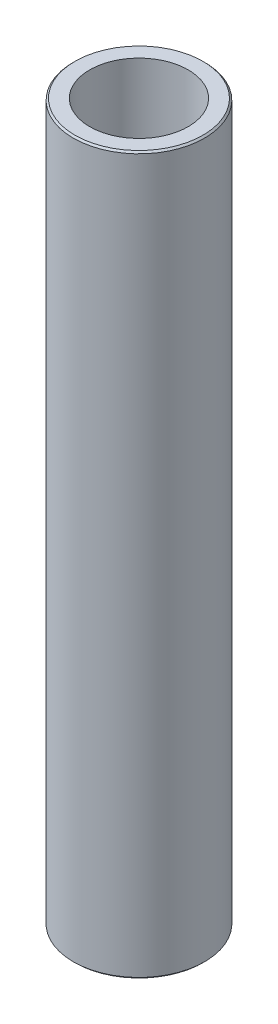
ISO-10303-21;
HEADER;
FILE_DESCRIPTION(('STEP AP214'),'2;1');
FILE_NAME('part.step','',(''),(''),'','','');
FILE_SCHEMA(('AUTOMOTIVE_DESIGN { 1 0 10303 214 1 1 1 1 }'));
ENDSEC;
DATA;
#1=APPLICATION_CONTEXT('core data for automotive mechanical design processes');
#2=APPLICATION_PROTOCOL_DEFINITION('international standard','automotive_design',2000,#1);
#3=PRODUCT_CONTEXT('',#1,'mechanical');
#4=PRODUCT('Part','Part','',(#3));
#5=PRODUCT_RELATED_PRODUCT_CATEGORY('part','',(#4));
#6=PRODUCT_DEFINITION_FORMATION('','',#4);
#7=PRODUCT_DEFINITION_CONTEXT('part definition',#1,'design');
#8=PRODUCT_DEFINITION('design','',#6,#7);
#9=PRODUCT_DEFINITION_SHAPE('','',#8);
#10=(LENGTH_UNIT() NAMED_UNIT(*) SI_UNIT(.MILLI.,.METRE.));
#11=(NAMED_UNIT(*) PLANE_ANGLE_UNIT() SI_UNIT($,.RADIAN.));
#12=(NAMED_UNIT(*) SI_UNIT($,.STERADIAN.) SOLID_ANGLE_UNIT());
#13=UNCERTAINTY_MEASURE_WITH_UNIT(LENGTH_MEASURE(1.E-05),#10,'distance_accuracy_value','');
#14=(GEOMETRIC_REPRESENTATION_CONTEXT(3) GLOBAL_UNCERTAINTY_ASSIGNED_CONTEXT((#13)) GLOBAL_UNIT_ASSIGNED_CONTEXT((#10,
#11,#12)) REPRESENTATION_CONTEXT('',''));
#15=CARTESIAN_POINT('',(0.,0.,0.));
#16=DIRECTION('',(0.,0.,1.));
#17=DIRECTION('',(1.,0.,0.));
#18=AXIS2_PLACEMENT_3D('',#15,#16,#17);
#19=CARTESIAN_POINT('',(0.,600.,0.));
#20=DIRECTION('',(0.,-1.,0.));
#21=DIRECTION('',(0.,0.,-1.));
#22=AXIS2_PLACEMENT_3D('',#19,#20,#21);
#23=CYLINDRICAL_SURFACE('',#22,55.);
#24=CARTESIAN_POINT('',(0.,598.597481149156,0.));
#25=DIRECTION('',(0.,1.,0.));
#26=DIRECTION('',(0.,0.,1.));
#27=AXIS2_PLACEMENT_3D('',#24,#25,#26);
#28=CIRCLE('',#27,55.);
#29=CARTESIAN_POINT('',(0.,598.597481149156,55.));
#30=VERTEX_POINT('',#29);
#31=EDGE_CURVE('E50',#30,#30,#28,.F.);
#32=ORIENTED_EDGE('',*,*,#31,.T.);
#33=EDGE_LOOP('',(#32));
#34=FACE_BOUND('',#33,.T.);
#35=CARTESIAN_POINT('',(0.,1.40251885084397,0.));
#36=DIRECTION('',(0.,1.,0.));
#37=DIRECTION('',(0.,0.,1.));
#38=AXIS2_PLACEMENT_3D('',#35,#36,#37);
#39=CIRCLE('',#38,55.);
#40=CARTESIAN_POINT('',(0.,1.40251885084397,55.));
#41=VERTEX_POINT('',#40);
#42=EDGE_CURVE('E51',#41,#41,#39,.T.);
#43=ORIENTED_EDGE('',*,*,#42,.T.);
#44=EDGE_LOOP('',(#43));
#45=FACE_BOUND('',#44,.T.);
#46=ADVANCED_FACE('F39',(#34,#45),#23,.T.);
#47=CARTESIAN_POINT('',(0.,600.,0.));
#48=DIRECTION('',(0.,1.,0.));
#49=DIRECTION('',(0.,0.,1.));
#50=AXIS2_PLACEMENT_3D('',#47,#48,#49);
#51=PLANE('',#50);
#52=CARTESIAN_POINT('',(0.,600.,0.));
#53=DIRECTION('',(0.,1.,0.));
#54=DIRECTION('',(0.,0.,1.));
#55=AXIS2_PLACEMENT_3D('',#52,#53,#54);
#56=CIRCLE('',#55,53.5974811491557);
#57=CARTESIAN_POINT('',(0.,600.,53.5974811491557));
#58=VERTEX_POINT('',#57);
#59=EDGE_CURVE('E54',#58,#58,#56,.T.);
#60=ORIENTED_EDGE('',*,*,#59,.T.);
#61=EDGE_LOOP('',(#60));
#62=FACE_BOUND('',#61,.T.);
#63=CARTESIAN_POINT('',(0.,600.,0.));
#64=DIRECTION('',(0.,1.,0.));
#65=DIRECTION('',(0.,0.,1.));
#66=AXIS2_PLACEMENT_3D('',#63,#64,#65);
#67=CIRCLE('',#66,41.2360951926562);
#68=CARTESIAN_POINT('',(0.,600.,41.2360951926562));
#69=VERTEX_POINT('',#68);
#70=EDGE_CURVE('E58',#69,#69,#67,.T.);
#71=ORIENTED_EDGE('',*,*,#70,.F.);
#72=EDGE_LOOP('',(#71));
#73=FACE_BOUND('',#72,.T.);
#74=ADVANCED_FACE('F69',(#62,#73),#51,.T.);
#75=CARTESIAN_POINT('',(0.,0.,0.));
#76=DIRECTION('',(0.,1.,0.));
#77=DIRECTION('',(0.,0.,1.));
#78=AXIS2_PLACEMENT_3D('',#75,#76,#77);
#79=PLANE('',#78);
#80=CARTESIAN_POINT('',(0.,0.,0.));
#81=DIRECTION('',(0.,1.,0.));
#82=DIRECTION('',(0.,0.,1.));
#83=AXIS2_PLACEMENT_3D('',#80,#81,#82);
#84=CIRCLE('',#83,53.597481149156);
#85=CARTESIAN_POINT('',(0.,0.,53.597481149156));
#86=VERTEX_POINT('',#85);
#87=EDGE_CURVE('E10',#86,#86,#84,.F.);
#88=ORIENTED_EDGE('',*,*,#87,.T.);
#89=EDGE_LOOP('',(#88));
#90=FACE_BOUND('',#89,.T.);
#91=CARTESIAN_POINT('',(0.,0.,0.));
#92=DIRECTION('',(0.,1.,0.));
#93=DIRECTION('',(0.,0.,1.));
#94=AXIS2_PLACEMENT_3D('',#91,#92,#93);
#95=CIRCLE('',#94,41.2360951926562);
#96=CARTESIAN_POINT('',(0.,0.,41.2360951926562));
#97=VERTEX_POINT('',#96);
#98=EDGE_CURVE('E63',#97,#97,#95,.T.);
#99=ORIENTED_EDGE('',*,*,#98,.T.);
#100=EDGE_LOOP('',(#99));
#101=FACE_BOUND('',#100,.T.);
#102=ADVANCED_FACE('F75',(#90,#101),#79,.F.);
#103=CARTESIAN_POINT('',(0.,600.,0.));
#104=DIRECTION('',(0.,-1.,0.));
#105=DIRECTION('',(0.,0.,-1.));
#106=AXIS2_PLACEMENT_3D('',#103,#104,#105);
#107=CYLINDRICAL_SURFACE('',#106,41.2360951926562);
#108=ORIENTED_EDGE('',*,*,#70,.T.);
#109=EDGE_LOOP('',(#108));
#110=FACE_BOUND('',#109,.T.);
#111=ORIENTED_EDGE('',*,*,#98,.F.);
#112=EDGE_LOOP('',(#111));
#113=FACE_BOUND('',#112,.T.);
#114=ADVANCED_FACE('F70',(#110,#113),#107,.F.);
#115=CARTESIAN_POINT('',(0.,600.,0.));
#116=DIRECTION('',(0.,-1.,0.));
#117=DIRECTION('',(0.,0.,-1.));
#118=AXIS2_PLACEMENT_3D('',#115,#116,#117);
#119=CONICAL_SURFACE('',#118,53.5974811491557,0.785398163397431);
#120=ORIENTED_EDGE('',*,*,#31,.F.);
#121=EDGE_LOOP('',(#120));
#122=FACE_BOUND('',#121,.T.);
#123=ORIENTED_EDGE('',*,*,#59,.F.);
#124=EDGE_LOOP('',(#123));
#125=FACE_BOUND('',#124,.T.);
#126=ADVANCED_FACE('F81',(#122,#125),#119,.T.);
#127=CARTESIAN_POINT('',(0.,1.40251885084397,0.));
#128=DIRECTION('',(0.,1.,0.));
#129=DIRECTION('',(0.,0.,1.));
#130=AXIS2_PLACEMENT_3D('',#127,#128,#129);
#131=CONICAL_SURFACE('',#130,55.,0.785398163397471);
#132=ORIENTED_EDGE('',*,*,#87,.F.);
#133=EDGE_LOOP('',(#132));
#134=FACE_BOUND('',#133,.T.);
#135=ORIENTED_EDGE('',*,*,#42,.F.);
#136=EDGE_LOOP('',(#135));
#137=FACE_BOUND('',#136,.T.);
#138=ADVANCED_FACE('F45',(#134,#137),#131,.T.);
#139=CLOSED_SHELL('',(#46,#74,#102,#114,#126,#138));
#140=MANIFOLD_SOLID_BREP('B2',#139);
#141=ADVANCED_BREP_SHAPE_REPRESENTATION('',(#18,#140),#14);
#142=SHAPE_DEFINITION_REPRESENTATION(#9,#141);
ENDSEC;
END-ISO-10303-21;
